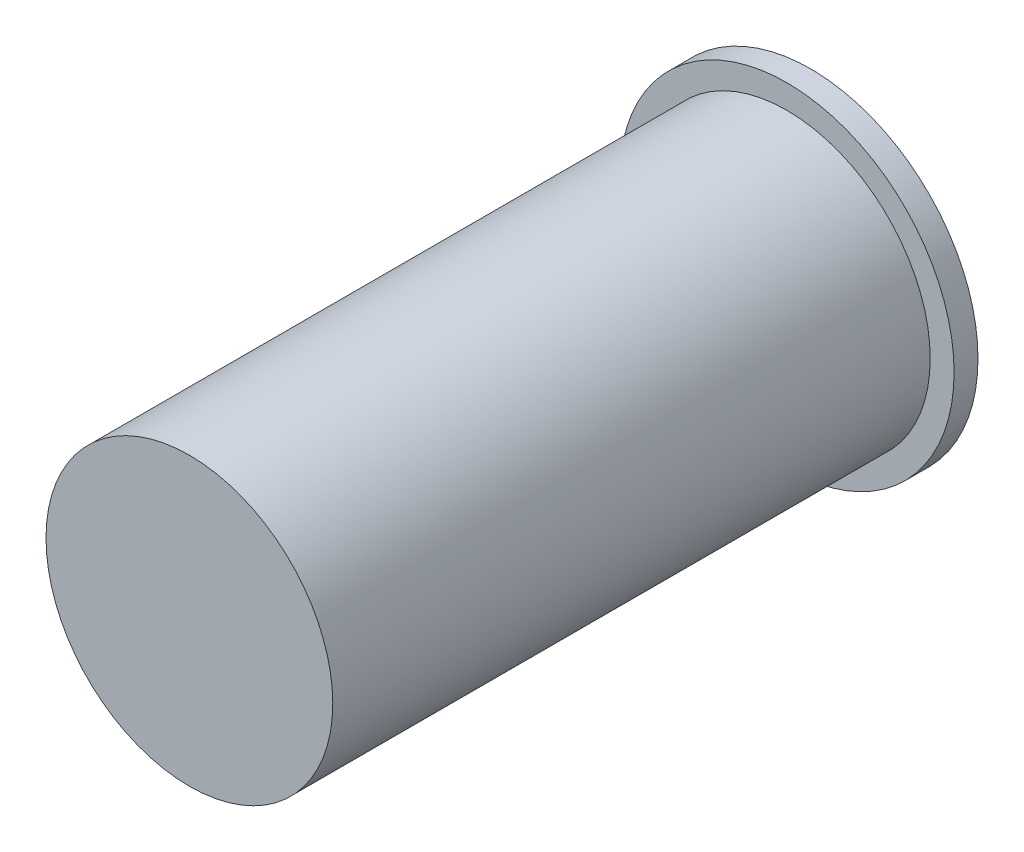
ISO-10303-21;
HEADER;
FILE_DESCRIPTION(('STEP AP214'),'2;1');
FILE_NAME('part.step','',(''),(''),'','','');
FILE_SCHEMA(('AUTOMOTIVE_DESIGN { 1 0 10303 214 1 1 1 1 }'));
ENDSEC;
DATA;
#1=APPLICATION_CONTEXT('core data for automotive mechanical design processes');
#2=APPLICATION_PROTOCOL_DEFINITION('international standard','automotive_design',2000,#1);
#3=PRODUCT_CONTEXT('',#1,'mechanical');
#4=PRODUCT('Part','Part','',(#3));
#5=PRODUCT_RELATED_PRODUCT_CATEGORY('part','',(#4));
#6=PRODUCT_DEFINITION_FORMATION('','',#4);
#7=PRODUCT_DEFINITION_CONTEXT('part definition',#1,'design');
#8=PRODUCT_DEFINITION('design','',#6,#7);
#9=PRODUCT_DEFINITION_SHAPE('','',#8);
#10=(LENGTH_UNIT() NAMED_UNIT(*) SI_UNIT(.MILLI.,.METRE.));
#11=(NAMED_UNIT(*) PLANE_ANGLE_UNIT() SI_UNIT($,.RADIAN.));
#12=(NAMED_UNIT(*) SI_UNIT($,.STERADIAN.) SOLID_ANGLE_UNIT());
#13=UNCERTAINTY_MEASURE_WITH_UNIT(LENGTH_MEASURE(1.E-05),#10,'distance_accuracy_value','');
#14=(GEOMETRIC_REPRESENTATION_CONTEXT(3) GLOBAL_UNCERTAINTY_ASSIGNED_CONTEXT((#13)) GLOBAL_UNIT_ASSIGNED_CONTEXT((#10,
#11,#12)) REPRESENTATION_CONTEXT('',''));
#15=CARTESIAN_POINT('',(0.,0.,0.));
#16=DIRECTION('',(0.,0.,1.));
#17=DIRECTION('',(1.,0.,0.));
#18=AXIS2_PLACEMENT_3D('',#15,#16,#17);
#19=CARTESIAN_POINT('',(-3.67928468859102,5.51208821376281,0.508));
#20=DIRECTION('',(0.,0.,-1.));
#21=DIRECTION('',(-1.,0.,0.));
#22=AXIS2_PLACEMENT_3D('',#19,#20,#21);
#23=CYLINDRICAL_SURFACE('',#22,3.556);
#24=CARTESIAN_POINT('',(-3.67928468859102,5.51208821376281,0.508));
#25=DIRECTION('',(0.,0.,1.));
#26=DIRECTION('',(1.,0.,0.));
#27=AXIS2_PLACEMENT_3D('',#24,#25,#26);
#28=CIRCLE('',#27,3.556);
#29=CARTESIAN_POINT('',(-0.123284688591022,5.51208821376281,0.508));
#30=VERTEX_POINT('',#29);
#31=EDGE_CURVE('E38',#30,#30,#28,.T.);
#32=ORIENTED_EDGE('',*,*,#31,.F.);
#33=EDGE_LOOP('',(#32));
#34=FACE_BOUND('',#33,.T.);
#35=CARTESIAN_POINT('',(-3.67928468859102,5.51208821376281,0.));
#36=DIRECTION('',(0.,0.,1.));
#37=DIRECTION('',(1.,0.,0.));
#38=AXIS2_PLACEMENT_3D('',#35,#36,#37);
#39=CIRCLE('',#38,3.556);
#40=CARTESIAN_POINT('',(-0.123284688591022,5.51208821376281,0.));
#41=VERTEX_POINT('',#40);
#42=EDGE_CURVE('E34',#41,#41,#39,.T.);
#43=ORIENTED_EDGE('',*,*,#42,.T.);
#44=EDGE_LOOP('',(#43));
#45=FACE_BOUND('',#44,.T.);
#46=ADVANCED_FACE('F31',(#34,#45),#23,.T.);
#47=CARTESIAN_POINT('',(-3.67928468859102,5.51208821376281,0.508));
#48=DIRECTION('',(0.,0.,1.));
#49=DIRECTION('',(1.,0.,0.));
#50=AXIS2_PLACEMENT_3D('',#47,#48,#49);
#51=PLANE('',#50);
#52=CARTESIAN_POINT('',(-3.67928468859102,5.51208821376281,0.508));
#53=DIRECTION('',(0.,0.,1.));
#54=DIRECTION('',(1.,0.,0.));
#55=AXIS2_PLACEMENT_3D('',#52,#53,#54);
#56=CIRCLE('',#55,3.048);
#57=CARTESIAN_POINT('',(-0.631284688591022,5.51208821376281,0.508));
#58=VERTEX_POINT('',#57);
#59=EDGE_CURVE('E10',#58,#58,#56,.T.);
#60=ORIENTED_EDGE('',*,*,#59,.F.);
#61=EDGE_LOOP('',(#60));
#62=FACE_BOUND('',#61,.T.);
#63=ORIENTED_EDGE('',*,*,#31,.T.);
#64=EDGE_LOOP('',(#63));
#65=FACE_BOUND('',#64,.T.);
#66=ADVANCED_FACE('F55',(#62,#65),#51,.T.);
#67=CARTESIAN_POINT('',(-3.67928468859102,5.51208821376281,0.));
#68=DIRECTION('',(0.,0.,1.));
#69=DIRECTION('',(1.,0.,0.));
#70=AXIS2_PLACEMENT_3D('',#67,#68,#69);
#71=PLANE('',#70);
#72=ORIENTED_EDGE('',*,*,#42,.F.);
#73=EDGE_LOOP('',(#72));
#74=FACE_BOUND('',#73,.T.);
#75=ADVANCED_FACE('F52',(#74),#71,.F.);
#76=CARTESIAN_POINT('',(-3.67928468859102,5.51208821376281,13.208));
#77=DIRECTION('',(0.,0.,-1.));
#78=DIRECTION('',(-1.,0.,0.));
#79=AXIS2_PLACEMENT_3D('',#76,#77,#78);
#80=CYLINDRICAL_SURFACE('',#79,3.048);
#81=CARTESIAN_POINT('',(-3.67928468859102,5.51208821376281,13.208));
#82=DIRECTION('',(0.,0.,1.));
#83=DIRECTION('',(1.,0.,0.));
#84=AXIS2_PLACEMENT_3D('',#81,#82,#83);
#85=CIRCLE('',#84,3.048);
#86=CARTESIAN_POINT('',(-0.631284688591022,5.51208821376281,13.208));
#87=VERTEX_POINT('',#86);
#88=EDGE_CURVE('E44',#87,#87,#85,.T.);
#89=ORIENTED_EDGE('',*,*,#88,.F.);
#90=EDGE_LOOP('',(#89));
#91=FACE_BOUND('',#90,.T.);
#92=ORIENTED_EDGE('',*,*,#59,.T.);
#93=EDGE_LOOP('',(#92));
#94=FACE_BOUND('',#93,.T.);
#95=ADVANCED_FACE('F54',(#91,#94),#80,.T.);
#96=CARTESIAN_POINT('',(-3.67928468859102,5.51208821376281,13.208));
#97=DIRECTION('',(0.,0.,1.));
#98=DIRECTION('',(1.,0.,0.));
#99=AXIS2_PLACEMENT_3D('',#96,#97,#98);
#100=PLANE('',#99);
#101=ORIENTED_EDGE('',*,*,#88,.T.);
#102=EDGE_LOOP('',(#101));
#103=FACE_BOUND('',#102,.T.);
#104=ADVANCED_FACE('F60',(#103),#100,.T.);
#105=CLOSED_SHELL('',(#46,#66,#75,#95,#104));
#106=MANIFOLD_SOLID_BREP('B2',#105);
#107=ADVANCED_BREP_SHAPE_REPRESENTATION('',(#18,#106),#14);
#108=SHAPE_DEFINITION_REPRESENTATION(#9,#107);
ENDSEC;
END-ISO-10303-21;
